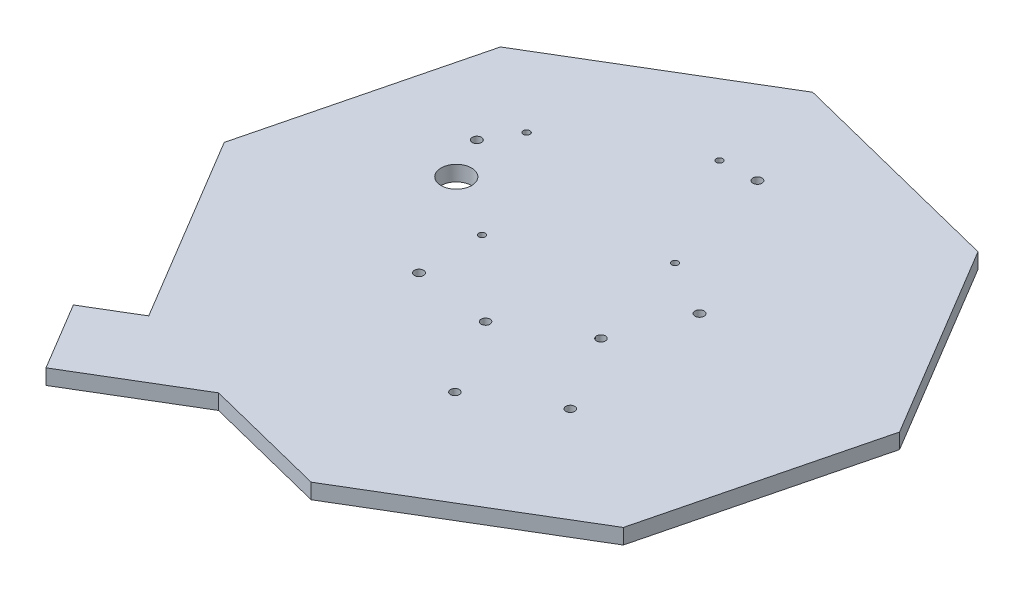
ISO-10303-21;
HEADER;
FILE_DESCRIPTION(('STEP AP214'),'2;1');
FILE_NAME('part.step','',(''),(''),'','','');
FILE_SCHEMA(('AUTOMOTIVE_DESIGN { 1 0 10303 214 1 1 1 1 }'));
ENDSEC;
DATA;
#1=APPLICATION_CONTEXT('core data for automotive mechanical design processes');
#2=APPLICATION_PROTOCOL_DEFINITION('international standard','automotive_design',2000,#1);
#3=PRODUCT_CONTEXT('',#1,'mechanical');
#4=PRODUCT('Part','Part','',(#3));
#5=PRODUCT_RELATED_PRODUCT_CATEGORY('part','',(#4));
#6=PRODUCT_DEFINITION_FORMATION('','',#4);
#7=PRODUCT_DEFINITION_CONTEXT('part definition',#1,'design');
#8=PRODUCT_DEFINITION('design','',#6,#7);
#9=PRODUCT_DEFINITION_SHAPE('','',#8);
#10=(LENGTH_UNIT() NAMED_UNIT(*) SI_UNIT(.MILLI.,.METRE.));
#11=(NAMED_UNIT(*) PLANE_ANGLE_UNIT() SI_UNIT($,.RADIAN.));
#12=(NAMED_UNIT(*) SI_UNIT($,.STERADIAN.) SOLID_ANGLE_UNIT());
#13=UNCERTAINTY_MEASURE_WITH_UNIT(LENGTH_MEASURE(1.E-05),#10,'distance_accuracy_value','');
#14=(GEOMETRIC_REPRESENTATION_CONTEXT(3) GLOBAL_UNCERTAINTY_ASSIGNED_CONTEXT((#13)) GLOBAL_UNIT_ASSIGNED_CONTEXT((#10,
#11,#12)) REPRESENTATION_CONTEXT('',''));
#15=CARTESIAN_POINT('',(0.,0.,0.));
#16=DIRECTION('',(0.,0.,1.));
#17=DIRECTION('',(1.,0.,0.));
#18=AXIS2_PLACEMENT_3D('',#15,#16,#17);
#19=CARTESIAN_POINT('',(122.390514677117,6.35,-18.0710827040052));
#20=DIRECTION('',(-0.858073020274862,0.,0.513527693387977));
#21=DIRECTION('',(0.513527693387977,0.,0.858073020274862));
#22=AXIS2_PLACEMENT_3D('',#19,#20,#21);
#23=PLANE('',#22);
#24=DIRECTION('',(-0.513527693387977,0.,-0.858073020274862));
#25=VECTOR('',#24,1.);
#26=CARTESIAN_POINT('',(122.390514677117,0.,-18.0710827040052));
#27=LINE('',#26,#25);
#28=CARTESIAN_POINT('',(122.390514677117,0.,-18.0710827040052));
#29=VERTEX_POINT('',#28);
#30=CARTESIAN_POINT('',(73.7649777577163,0.,-99.3213480044863));
#31=VERTEX_POINT('',#30);
#32=EDGE_CURVE('E165',#29,#31,#27,.T.);
#33=ORIENTED_EDGE('',*,*,#32,.T.);
#34=DIRECTION('',(0.,-1.,0.));
#35=VECTOR('',#34,1.);
#36=CARTESIAN_POINT('',(73.7649777577163,6.35,-99.3213480044863));
#37=LINE('',#36,#35);
#38=CARTESIAN_POINT('',(73.7649777577163,6.35,-99.3213480044863));
#39=VERTEX_POINT('',#38);
#40=EDGE_CURVE('E13',#39,#31,#37,.T.);
#41=ORIENTED_EDGE('',*,*,#40,.F.);
#42=DIRECTION('',(-0.513527693387977,0.,-0.858073020274862));
#43=VECTOR('',#42,1.);
#44=CARTESIAN_POINT('',(122.390514677117,6.35,-18.0710827040052));
#45=LINE('',#44,#43);
#46=CARTESIAN_POINT('',(122.390514677117,6.35,-18.0710827040052));
#47=VERTEX_POINT('',#46);
#48=EDGE_CURVE('E168',#47,#39,#45,.T.);
#49=ORIENTED_EDGE('',*,*,#48,.F.);
#50=DIRECTION('',(0.,-1.,0.));
#51=VECTOR('',#50,1.);
#52=CARTESIAN_POINT('',(122.390514677117,6.35,-18.0710827040052));
#53=LINE('',#52,#51);
#54=EDGE_CURVE('E185',#47,#29,#53,.T.);
#55=ORIENTED_EDGE('',*,*,#54,.T.);
#56=EDGE_LOOP('',(#33,#41,#49,#55));
#57=FACE_BOUND('',#56,.T.);
#58=ADVANCED_FACE('F44',(#57),#23,.F.);
#59=CARTESIAN_POINT('',(73.7649777577163,6.35,-99.3213480044863));
#60=DIRECTION('',(-0.243630337067852,0.,0.969868165711302));
#61=DIRECTION('',(0.969868165711302,0.,0.243630337067852));
#62=AXIS2_PLACEMENT_3D('',#59,#60,#61);
#63=PLANE('',#62);
#64=DIRECTION('',(-0.969868165711302,0.,-0.243630337067852));
#65=VECTOR('',#64,1.);
#66=CARTESIAN_POINT('',(73.7649777577163,0.,-99.3213480044863));
#67=LINE('',#66,#65);
#68=CARTESIAN_POINT('',(-18.0710827040052,0.,-122.390514677117));
#69=VERTEX_POINT('',#68);
#70=EDGE_CURVE('E188',#31,#69,#67,.T.);
#71=ORIENTED_EDGE('',*,*,#70,.T.);
#72=DIRECTION('',(0.,-1.,0.));
#73=VECTOR('',#72,1.);
#74=CARTESIAN_POINT('',(-18.0710827040052,6.35,-122.390514677117));
#75=LINE('',#74,#73);
#76=CARTESIAN_POINT('',(-18.0710827040052,6.35,-122.390514677117));
#77=VERTEX_POINT('',#76);
#78=EDGE_CURVE('E51',#77,#69,#75,.T.);
#79=ORIENTED_EDGE('',*,*,#78,.F.);
#80=DIRECTION('',(-0.969868165711302,0.,-0.243630337067852));
#81=VECTOR('',#80,1.);
#82=CARTESIAN_POINT('',(73.7649777577163,6.35,-99.3213480044863));
#83=LINE('',#82,#81);
#84=EDGE_CURVE('E171',#39,#77,#83,.T.);
#85=ORIENTED_EDGE('',*,*,#84,.F.);
#86=ORIENTED_EDGE('',*,*,#40,.T.);
#87=EDGE_LOOP('',(#71,#79,#85,#86));
#88=FACE_BOUND('',#87,.T.);
#89=ADVANCED_FACE('F233',(#88),#63,.F.);
#90=CARTESIAN_POINT('',(-18.0710827040052,6.35,-122.390514677117));
#91=DIRECTION('',(0.513527693387977,0.,0.858073020274862));
#92=DIRECTION('',(0.858073020274862,0.,-0.513527693387977));
#93=AXIS2_PLACEMENT_3D('',#90,#91,#92);
#94=PLANE('',#93);
#95=DIRECTION('',(-0.858073020274862,0.,0.513527693387977));
#96=VECTOR('',#95,1.);
#97=CARTESIAN_POINT('',(-18.0710827040052,0.,-122.390514677117));
#98=LINE('',#97,#96);
#99=CARTESIAN_POINT('',(-99.3213480044863,0.,-73.7649777577163));
#100=VERTEX_POINT('',#99);
#101=EDGE_CURVE('E190',#69,#100,#98,.T.);
#102=ORIENTED_EDGE('',*,*,#101,.T.);
#103=DIRECTION('',(0.,-1.,0.));
#104=VECTOR('',#103,1.);
#105=CARTESIAN_POINT('',(-99.3213480044863,6.35,-73.7649777577163));
#106=LINE('',#105,#104);
#107=CARTESIAN_POINT('',(-99.3213480044863,6.35,-73.7649777577163));
#108=VERTEX_POINT('',#107);
#109=EDGE_CURVE('E212',#108,#100,#106,.T.);
#110=ORIENTED_EDGE('',*,*,#109,.F.);
#111=DIRECTION('',(-0.858073020274862,0.,0.513527693387977));
#112=VECTOR('',#111,1.);
#113=CARTESIAN_POINT('',(-18.0710827040052,6.35,-122.390514677117));
#114=LINE('',#113,#112);
#115=EDGE_CURVE('E174',#77,#108,#114,.T.);
#116=ORIENTED_EDGE('',*,*,#115,.F.);
#117=ORIENTED_EDGE('',*,*,#78,.T.);
#118=EDGE_LOOP('',(#102,#110,#116,#117));
#119=FACE_BOUND('',#118,.T.);
#120=ADVANCED_FACE('F219',(#119),#94,.F.);
#121=CARTESIAN_POINT('',(-99.3213480044863,6.35,-73.7649777577163));
#122=DIRECTION('',(0.969868165711302,0.,0.243630337067852));
#123=DIRECTION('',(0.243630337067852,0.,-0.969868165711302));
#124=AXIS2_PLACEMENT_3D('',#121,#122,#123);
#125=PLANE('',#124);
#126=DIRECTION('',(-0.243630337067852,0.,0.969868165711302));
#127=VECTOR('',#126,1.);
#128=CARTESIAN_POINT('',(-99.3213480044863,0.,-73.7649777577163));
#129=LINE('',#128,#127);
#130=CARTESIAN_POINT('',(-122.390514677117,0.,18.0710827040053));
#131=VERTEX_POINT('',#130);
#132=EDGE_CURVE('E192',#100,#131,#129,.T.);
#133=ORIENTED_EDGE('',*,*,#132,.T.);
#134=DIRECTION('',(0.,-1.,0.));
#135=VECTOR('',#134,1.);
#136=CARTESIAN_POINT('',(-122.390514677117,6.35,18.0710827040053));
#137=LINE('',#136,#135);
#138=CARTESIAN_POINT('',(-122.390514677117,6.35,18.0710827040053));
#139=VERTEX_POINT('',#138);
#140=EDGE_CURVE('E209',#139,#131,#137,.T.);
#141=ORIENTED_EDGE('',*,*,#140,.F.);
#142=DIRECTION('',(-0.243630337067852,0.,0.969868165711302));
#143=VECTOR('',#142,1.);
#144=CARTESIAN_POINT('',(-99.3213480044863,6.35,-73.7649777577163));
#145=LINE('',#144,#143);
#146=EDGE_CURVE('E176',#108,#139,#145,.T.);
#147=ORIENTED_EDGE('',*,*,#146,.F.);
#148=ORIENTED_EDGE('',*,*,#109,.T.);
#149=EDGE_LOOP('',(#133,#141,#147,#148));
#150=FACE_BOUND('',#149,.T.);
#151=ADVANCED_FACE('F226',(#150),#125,.F.);
#152=CARTESIAN_POINT('',(-122.390514677117,6.35,18.0710827040053));
#153=DIRECTION('',(0.858073020274862,0.,-0.513527693387977));
#154=DIRECTION('',(-0.513527693387977,0.,-0.858073020274862));
#155=AXIS2_PLACEMENT_3D('',#152,#153,#154);
#156=PLANE('',#155);
#157=DIRECTION('',(0.513527693387977,0.,0.858073020274862));
#158=VECTOR('',#157,1.);
#159=CARTESIAN_POINT('',(-122.390514677117,0.,18.0710827040053));
#160=LINE('',#159,#158);
#161=CARTESIAN_POINT('',(-75.5910822354039,0.,96.2700403443889));
#162=VERTEX_POINT('',#161);
#163=EDGE_CURVE('E194',#131,#162,#160,.T.);
#164=ORIENTED_EDGE('',*,*,#163,.T.);
#165=DIRECTION('',(0.,1.,0.));
#166=VECTOR('',#165,1.);
#167=CARTESIAN_POINT('',(-75.5910822354039,0.,96.2700403443889));
#168=LINE('',#167,#166);
#169=CARTESIAN_POINT('',(-75.5910822354039,6.35,96.2700403443889));
#170=VERTEX_POINT('',#169);
#171=EDGE_CURVE('E66',#162,#170,#168,.T.);
#172=ORIENTED_EDGE('',*,*,#171,.T.);
#173=DIRECTION('',(0.513527693387977,0.,0.858073020274862));
#174=VECTOR('',#173,1.);
#175=CARTESIAN_POINT('',(-122.390514677117,6.35,18.0710827040053));
#176=LINE('',#175,#174);
#177=EDGE_CURVE('E178',#139,#170,#176,.T.);
#178=ORIENTED_EDGE('',*,*,#177,.F.);
#179=ORIENTED_EDGE('',*,*,#140,.T.);
#180=EDGE_LOOP('',(#164,#172,#178,#179));
#181=FACE_BOUND('',#180,.T.);
#182=ADVANCED_FACE('F228',(#181),#156,.F.);
#183=CARTESIAN_POINT('',(-73.7649777577163,6.35,99.3213480044863));
#184=DIRECTION('',(0.243630337067852,0.,-0.969868165711302));
#185=DIRECTION('',(-0.969868165711302,0.,-0.243630337067852));
#186=AXIS2_PLACEMENT_3D('',#183,#184,#185);
#187=PLANE('',#186);
#188=DIRECTION('',(0.969868165711302,0.,0.243630337067852));
#189=VECTOR('',#188,1.);
#190=CARTESIAN_POINT('',(-73.7649777577163,6.35,99.3213480044863));
#191=LINE('',#190,#189);
#192=CARTESIAN_POINT('',(-33.3521343303544,6.35,109.473031515881));
#193=VERTEX_POINT('',#192);
#194=CARTESIAN_POINT('',(18.0710827040052,6.35,122.390514677117));
#195=VERTEX_POINT('',#194);
#196=EDGE_CURVE('E58',#193,#195,#191,.T.);
#197=ORIENTED_EDGE('',*,*,#196,.F.);
#198=DIRECTION('',(0.,1.,0.));
#199=VECTOR('',#198,1.);
#200=CARTESIAN_POINT('',(-33.3521343303544,0.,109.473031515881));
#201=LINE('',#200,#199);
#202=CARTESIAN_POINT('',(-33.3521343303544,0.,109.473031515881));
#203=VERTEX_POINT('',#202);
#204=EDGE_CURVE('E163',#203,#193,#201,.T.);
#205=ORIENTED_EDGE('',*,*,#204,.F.);
#206=DIRECTION('',(0.969868165711302,0.,0.243630337067852));
#207=VECTOR('',#206,1.);
#208=CARTESIAN_POINT('',(-73.7649777577163,0.,99.3213480044863));
#209=LINE('',#208,#207);
#210=CARTESIAN_POINT('',(18.0710827040052,0.,122.390514677117));
#211=VERTEX_POINT('',#210);
#212=EDGE_CURVE('E196',#203,#211,#209,.T.);
#213=ORIENTED_EDGE('',*,*,#212,.T.);
#214=DIRECTION('',(0.,-1.,0.));
#215=VECTOR('',#214,1.);
#216=CARTESIAN_POINT('',(18.0710827040052,6.35,122.390514677117));
#217=LINE('',#216,#215);
#218=EDGE_CURVE('E206',#195,#211,#217,.T.);
#219=ORIENTED_EDGE('',*,*,#218,.F.);
#220=EDGE_LOOP('',(#197,#205,#213,#219));
#221=FACE_BOUND('',#220,.T.);
#222=ADVANCED_FACE('F245',(#221),#187,.F.);
#223=CARTESIAN_POINT('',(18.0710827040052,6.35,122.390514677117));
#224=DIRECTION('',(-0.513527693387977,0.,-0.858073020274862));
#225=DIRECTION('',(-0.858073020274862,0.,0.513527693387977));
#226=AXIS2_PLACEMENT_3D('',#223,#224,#225);
#227=PLANE('',#226);
#228=DIRECTION('',(0.858073020274862,0.,-0.513527693387977));
#229=VECTOR('',#228,1.);
#230=CARTESIAN_POINT('',(18.0710827040052,0.,122.390514677117));
#231=LINE('',#230,#229);
#232=CARTESIAN_POINT('',(99.3213480044863,0.,73.7649777577163));
#233=VERTEX_POINT('',#232);
#234=EDGE_CURVE('E198',#211,#233,#231,.T.);
#235=ORIENTED_EDGE('',*,*,#234,.T.);
#236=DIRECTION('',(0.,-1.,0.));
#237=VECTOR('',#236,1.);
#238=CARTESIAN_POINT('',(99.3213480044863,6.35,73.7649777577163));
#239=LINE('',#238,#237);
#240=CARTESIAN_POINT('',(99.3213480044863,6.35,73.7649777577163));
#241=VERTEX_POINT('',#240);
#242=EDGE_CURVE('E203',#241,#233,#239,.T.);
#243=ORIENTED_EDGE('',*,*,#242,.F.);
#244=DIRECTION('',(0.858073020274862,0.,-0.513527693387977));
#245=VECTOR('',#244,1.);
#246=CARTESIAN_POINT('',(18.0710827040052,6.35,122.390514677117));
#247=LINE('',#246,#245);
#248=EDGE_CURVE('E181',#195,#241,#247,.T.);
#249=ORIENTED_EDGE('',*,*,#248,.F.);
#250=ORIENTED_EDGE('',*,*,#218,.T.);
#251=EDGE_LOOP('',(#235,#243,#249,#250));
#252=FACE_BOUND('',#251,.T.);
#253=ADVANCED_FACE('F244',(#252),#227,.F.);
#254=CARTESIAN_POINT('',(99.3213480044863,6.35,73.7649777577163));
#255=DIRECTION('',(-0.969868165711302,0.,-0.243630337067852));
#256=DIRECTION('',(-0.243630337067852,0.,0.969868165711302));
#257=AXIS2_PLACEMENT_3D('',#254,#255,#256);
#258=PLANE('',#257);
#259=DIRECTION('',(0.243630337067852,0.,-0.969868165711302));
#260=VECTOR('',#259,1.);
#261=CARTESIAN_POINT('',(99.3213480044863,0.,73.7649777577163));
#262=LINE('',#261,#260);
#263=EDGE_CURVE('E172',#233,#29,#262,.T.);
#264=ORIENTED_EDGE('',*,*,#263,.T.);
#265=ORIENTED_EDGE('',*,*,#54,.F.);
#266=DIRECTION('',(0.243630337067852,0.,-0.969868165711302));
#267=VECTOR('',#266,1.);
#268=CARTESIAN_POINT('',(99.3213480044863,6.35,73.7649777577163));
#269=LINE('',#268,#267);
#270=EDGE_CURVE('E183',#241,#47,#269,.T.);
#271=ORIENTED_EDGE('',*,*,#270,.F.);
#272=ORIENTED_EDGE('',*,*,#242,.T.);
#273=EDGE_LOOP('',(#264,#265,#271,#272));
#274=FACE_BOUND('',#273,.T.);
#275=ADVANCED_FACE('F239',(#274),#258,.F.);
#276=CARTESIAN_POINT('',(39.381530863171,6.35,-156.773961571662));
#277=DIRECTION('',(0.,1.,0.));
#278=DIRECTION('',(0.,0.,1.));
#279=AXIS2_PLACEMENT_3D('',#276,#277,#278);
#280=PLANE('',#279);
#281=CARTESIAN_POINT('',(45.5711756113947,6.35,42.0686100720646));
#282=DIRECTION('',(0.,1.,0.));
#283=DIRECTION('',(0.,0.,1.));
#284=AXIS2_PLACEMENT_3D('',#281,#282,#283);
#285=CIRCLE('',#284,1.85000000000001);
#286=CARTESIAN_POINT('',(45.5711756113947,6.35,43.9186100720646));
#287=VERTEX_POINT('',#286);
#288=EDGE_CURVE('E348',#287,#287,#285,.T.);
#289=ORIENTED_EDGE('',*,*,#288,.F.);
#290=EDGE_LOOP('',(#289));
#291=FACE_BOUND('',#290,.T.);
#292=CARTESIAN_POINT('',(26.5706509560395,6.35,10.3199083218948));
#293=DIRECTION('',(0.,1.,0.));
#294=DIRECTION('',(0.,0.,1.));
#295=AXIS2_PLACEMENT_3D('',#292,#293,#294);
#296=CIRCLE('',#295,1.85);
#297=CARTESIAN_POINT('',(26.5706509560395,6.35,12.1699083218948));
#298=VERTEX_POINT('',#297);
#299=EDGE_CURVE('E350',#298,#298,#296,.T.);
#300=ORIENTED_EDGE('',*,*,#299,.F.);
#301=EDGE_LOOP('',(#300));
#302=FACE_BOUND('',#301,.T.);
#303=CARTESIAN_POINT('',(-3.46190475358064,6.35,28.293377590474));
#304=DIRECTION('',(0.,1.,0.));
#305=DIRECTION('',(0.,0.,1.));
#306=AXIS2_PLACEMENT_3D('',#303,#304,#305);
#307=CIRCLE('',#306,1.85);
#308=CARTESIAN_POINT('',(-3.46190475358064,6.35,30.143377590474));
#309=VERTEX_POINT('',#308);
#310=EDGE_CURVE('E356',#309,#309,#307,.T.);
#311=ORIENTED_EDGE('',*,*,#310,.F.);
#312=EDGE_LOOP('',(#311));
#313=FACE_BOUND('',#312,.T.);
#314=CARTESIAN_POINT('',(15.5386199017745,6.35,60.0420793406438));
#315=DIRECTION('',(0.,1.,0.));
#316=DIRECTION('',(0.,0.,1.));
#317=AXIS2_PLACEMENT_3D('',#314,#315,#316);
#318=CIRCLE('',#317,1.85);
#319=CARTESIAN_POINT('',(15.5386199017745,6.35,61.8920793406438));
#320=VERTEX_POINT('',#319);
#321=EDGE_CURVE('E362',#320,#320,#318,.T.);
#322=ORIENTED_EDGE('',*,*,#321,.F.);
#323=EDGE_LOOP('',(#322));
#324=FACE_BOUND('',#323,.T.);
#325=CARTESIAN_POINT('',(-34.8762662210874,6.35,24.5724175545645));
#326=DIRECTION('',(0.,-1.,0.));
#327=DIRECTION('',(0.,0.,-1.));
#328=AXIS2_PLACEMENT_3D('',#325,#326,#327);
#329=CIRCLE('',#328,1.905);
#330=CARTESIAN_POINT('',(-34.8762662210874,6.35,22.6674175545645));
#331=VERTEX_POINT('',#330);
#332=EDGE_CURVE('E371',#331,#331,#329,.T.);
#333=ORIENTED_EDGE('',*,*,#332,.T.);
#334=EDGE_LOOP('',(#333));
#335=FACE_BOUND('',#334,.T.);
#336=CARTESIAN_POINT('',(38.1371670741007,6.35,-19.1236538758185));
#337=DIRECTION('',(0.,-1.,0.));
#338=DIRECTION('',(0.,0.,-1.));
#339=AXIS2_PLACEMENT_3D('',#336,#337,#338);
#340=CIRCLE('',#339,1.905);
#341=CARTESIAN_POINT('',(38.1371670741007,6.35,-21.0286538758185));
#342=VERTEX_POINT('',#341);
#343=EDGE_CURVE('E377',#342,#342,#340,.T.);
#344=ORIENTED_EDGE('',*,*,#343,.T.);
#345=EDGE_LOOP('',(#344));
#346=FACE_BOUND('',#345,.T.);
#347=CARTESIAN_POINT('',(-70.7461756042376,6.35,-35.3639829116347));
#348=DIRECTION('',(0.,-1.,0.));
#349=DIRECTION('',(0.,0.,-1.));
#350=AXIS2_PLACEMENT_3D('',#347,#348,#349);
#351=CIRCLE('',#350,1.90500000000012);
#352=CARTESIAN_POINT('',(-70.7461756042376,6.35,-37.2689829116348));
#353=VERTEX_POINT('',#352);
#354=EDGE_CURVE('E383',#353,#353,#351,.T.);
#355=ORIENTED_EDGE('',*,*,#354,.T.);
#356=EDGE_LOOP('',(#355));
#357=FACE_BOUND('',#356,.T.);
#358=CARTESIAN_POINT('',(2.2672576909505,6.35,-79.0600543420177));
#359=DIRECTION('',(0.,-1.,0.));
#360=DIRECTION('',(0.,0.,-1.));
#361=AXIS2_PLACEMENT_3D('',#358,#359,#360);
#362=CIRCLE('',#361,1.90499999999999);
#363=CARTESIAN_POINT('',(2.2672576909505,6.35,-80.9650543420177));
#364=VERTEX_POINT('',#363);
#365=EDGE_CURVE('E389',#364,#364,#362,.T.);
#366=ORIENTED_EDGE('',*,*,#365,.T.);
#367=EDGE_LOOP('',(#366));
#368=FACE_BOUND('',#367,.T.);
#369=CARTESIAN_POINT('',(-61.7374407035275,6.35,-17.8144681380892));
#370=DIRECTION('',(0.,-1.,0.));
#371=DIRECTION('',(0.,0.,-1.));
#372=AXIS2_PLACEMENT_3D('',#369,#370,#371);
#373=CIRCLE('',#372,6.35);
#374=CARTESIAN_POINT('',(-61.7374407035275,6.35,-24.1644681380892));
#375=VERTEX_POINT('',#374);
#376=EDGE_CURVE('E395',#375,#375,#373,.T.);
#377=ORIENTED_EDGE('',*,*,#376,.T.);
#378=EDGE_LOOP('',(#377));
#379=FACE_BOUND('',#378,.T.);
#380=CARTESIAN_POINT('',(14.7947550289578,6.35,-32.2539175225384));
#381=DIRECTION('',(0.,-1.,0.));
#382=DIRECTION('',(0.,0.,-1.));
#383=AXIS2_PLACEMENT_3D('',#380,#381,#382);
#384=CIRCLE('',#383,1.3716);
#385=CARTESIAN_POINT('',(14.7947550289578,6.35,-33.6255175225384));
#386=VERTEX_POINT('',#385);
#387=EDGE_CURVE('E398',#386,#386,#384,.T.);
#388=ORIENTED_EDGE('',*,*,#387,.T.);
#389=EDGE_LOOP('',(#388));
#390=FACE_BOUND('',#389,.T.);
#391=CARTESIAN_POINT('',(-63.0560876535603,6.35,-48.3877849228927));
#392=DIRECTION('',(0.,-1.,0.));
#393=DIRECTION('',(0.,0.,-1.));
#394=AXIS2_PLACEMENT_3D('',#391,#392,#393);
#395=CIRCLE('',#394,1.3716);
#396=CARTESIAN_POINT('',(-63.0560876535603,6.35,-49.7593849228927));
#397=VERTEX_POINT('',#396);
#398=EDGE_CURVE('E404',#397,#397,#395,.T.);
#399=ORIENTED_EDGE('',*,*,#398,.T.);
#400=EDGE_LOOP('',(#399));
#401=FACE_BOUND('',#400,.T.);
#402=CARTESIAN_POINT('',(-35.4166920234166,6.35,-2.20406398184697));
#403=DIRECTION('',(0.,-1.,0.));
#404=DIRECTION('',(0.,0.,-1.));
#405=AXIS2_PLACEMENT_3D('',#402,#403,#404);
#406=CIRCLE('',#405,1.3716);
#407=CARTESIAN_POINT('',(-35.4166920234166,6.35,-3.57566398184697));
#408=VERTEX_POINT('',#407);
#409=EDGE_CURVE('E410',#408,#408,#406,.T.);
#410=ORIENTED_EDGE('',*,*,#409,.T.);
#411=EDGE_LOOP('',(#410));
#412=FACE_BOUND('',#411,.T.);
#413=CARTESIAN_POINT('',(-12.844640601186,6.35,-78.4376384635842));
#414=DIRECTION('',(0.,-1.,0.));
#415=DIRECTION('',(0.,0.,-1.));
#416=AXIS2_PLACEMENT_3D('',#413,#414,#415);
#417=CIRCLE('',#416,1.3716);
#418=CARTESIAN_POINT('',(-12.844640601186,6.35,-79.8092384635842));
#419=VERTEX_POINT('',#418);
#420=EDGE_CURVE('E161',#419,#419,#417,.T.);
#421=ORIENTED_EDGE('',*,*,#420,.T.);
#422=EDGE_LOOP('',(#421));
#423=FACE_BOUND('',#422,.T.);
#424=ORIENTED_EDGE('',*,*,#177,.T.);
#425=DIRECTION('',(-0.858073020274862,0.,0.513527693387977));
#426=VECTOR('',#425,1.);
#427=CARTESIAN_POINT('',(-75.5910822354039,6.35,96.2700403443889));
#428=LINE('',#427,#426);
#429=CARTESIAN_POINT('',(-95.2066314788873,6.35,108.009283415238));
#430=VERTEX_POINT('',#429);
#431=EDGE_CURVE('E159',#170,#430,#428,.T.);
#432=ORIENTED_EDGE('',*,*,#431,.T.);
#433=DIRECTION('',(0.513527693387978,0.,0.858073020274862));
#434=VECTOR('',#433,1.);
#435=CARTESIAN_POINT('',(-95.2066314788873,6.35,108.009283415238));
#436=LINE('',#435,#434);
#437=CARTESIAN_POINT('',(-78.2499470432163,6.35,136.342854544714));
#438=VERTEX_POINT('',#437);
#439=EDGE_CURVE('E133',#430,#438,#436,.T.);
#440=ORIENTED_EDGE('',*,*,#439,.T.);
#441=DIRECTION('',(0.858073020274862,0.,-0.513527693387977));
#442=VECTOR('',#441,1.);
#443=CARTESIAN_POINT('',(-78.2499470432163,6.35,136.342854544714));
#444=LINE('',#443,#442);
#445=EDGE_CURVE('E150',#438,#193,#444,.T.);
#446=ORIENTED_EDGE('',*,*,#445,.T.);
#447=ORIENTED_EDGE('',*,*,#196,.T.);
#448=ORIENTED_EDGE('',*,*,#248,.T.);
#449=ORIENTED_EDGE('',*,*,#270,.T.);
#450=ORIENTED_EDGE('',*,*,#48,.T.);
#451=ORIENTED_EDGE('',*,*,#84,.T.);
#452=ORIENTED_EDGE('',*,*,#115,.T.);
#453=ORIENTED_EDGE('',*,*,#146,.T.);
#454=EDGE_LOOP('',(#424,#432,#440,#446,#447,#448,#449,#450,#451,#452,#453));
#455=FACE_BOUND('',#454,.T.);
#456=ADVANCED_FACE('F230',(#291,#302,#313,#324,#335,#346,#357,#368,#379,#390,#401,#412,#423,
#455),#280,.T.);
#457=CARTESIAN_POINT('',(39.381530863171,0.,-156.773961571662));
#458=DIRECTION('',(0.,1.,0.));
#459=DIRECTION('',(0.,0.,1.));
#460=AXIS2_PLACEMENT_3D('',#457,#458,#459);
#461=PLANE('',#460);
#462=CARTESIAN_POINT('',(45.5711756113947,0.,42.0686100720646));
#463=DIRECTION('',(0.,1.,0.));
#464=DIRECTION('',(0.,0.,1.));
#465=AXIS2_PLACEMENT_3D('',#462,#463,#464);
#466=CIRCLE('',#465,1.85000000000001);
#467=CARTESIAN_POINT('',(45.5711756113947,0.,43.9186100720646));
#468=VERTEX_POINT('',#467);
#469=EDGE_CURVE('E345',#468,#468,#466,.T.);
#470=ORIENTED_EDGE('',*,*,#469,.T.);
#471=EDGE_LOOP('',(#470));
#472=FACE_BOUND('',#471,.T.);
#473=CARTESIAN_POINT('',(26.5706509560395,0.,10.3199083218948));
#474=DIRECTION('',(0.,1.,0.));
#475=DIRECTION('',(0.,0.,1.));
#476=AXIS2_PLACEMENT_3D('',#473,#474,#475);
#477=CIRCLE('',#476,1.85);
#478=CARTESIAN_POINT('',(26.5706509560395,0.,12.1699083218948));
#479=VERTEX_POINT('',#478);
#480=EDGE_CURVE('E353',#479,#479,#477,.T.);
#481=ORIENTED_EDGE('',*,*,#480,.T.);
#482=EDGE_LOOP('',(#481));
#483=FACE_BOUND('',#482,.T.);
#484=CARTESIAN_POINT('',(-3.46190475358064,0.,28.293377590474));
#485=DIRECTION('',(0.,1.,0.));
#486=DIRECTION('',(0.,0.,1.));
#487=AXIS2_PLACEMENT_3D('',#484,#485,#486);
#488=CIRCLE('',#487,1.85);
#489=CARTESIAN_POINT('',(-3.46190475358064,0.,30.143377590474));
#490=VERTEX_POINT('',#489);
#491=EDGE_CURVE('E359',#490,#490,#488,.T.);
#492=ORIENTED_EDGE('',*,*,#491,.T.);
#493=EDGE_LOOP('',(#492));
#494=FACE_BOUND('',#493,.T.);
#495=CARTESIAN_POINT('',(15.5386199017745,0.,60.0420793406438));
#496=DIRECTION('',(0.,1.,0.));
#497=DIRECTION('',(0.,0.,1.));
#498=AXIS2_PLACEMENT_3D('',#495,#496,#497);
#499=CIRCLE('',#498,1.85);
#500=CARTESIAN_POINT('',(15.5386199017745,0.,61.8920793406438));
#501=VERTEX_POINT('',#500);
#502=EDGE_CURVE('E365',#501,#501,#499,.T.);
#503=ORIENTED_EDGE('',*,*,#502,.T.);
#504=EDGE_LOOP('',(#503));
#505=FACE_BOUND('',#504,.T.);
#506=CARTESIAN_POINT('',(-34.8762662210874,0.,24.5724175545645));
#507=DIRECTION('',(0.,-1.,0.));
#508=DIRECTION('',(0.,0.,-1.));
#509=AXIS2_PLACEMENT_3D('',#506,#507,#508);
#510=CIRCLE('',#509,1.905);
#511=CARTESIAN_POINT('',(-34.8762662210874,0.,22.6674175545645));
#512=VERTEX_POINT('',#511);
#513=EDGE_CURVE('E368',#512,#512,#510,.T.);
#514=ORIENTED_EDGE('',*,*,#513,.F.);
#515=EDGE_LOOP('',(#514));
#516=FACE_BOUND('',#515,.T.);
#517=CARTESIAN_POINT('',(38.1371670741007,0.,-19.1236538758185));
#518=DIRECTION('',(0.,-1.,0.));
#519=DIRECTION('',(0.,0.,-1.));
#520=AXIS2_PLACEMENT_3D('',#517,#518,#519);
#521=CIRCLE('',#520,1.905);
#522=CARTESIAN_POINT('',(38.1371670741007,0.,-21.0286538758185));
#523=VERTEX_POINT('',#522);
#524=EDGE_CURVE('E374',#523,#523,#521,.T.);
#525=ORIENTED_EDGE('',*,*,#524,.F.);
#526=EDGE_LOOP('',(#525));
#527=FACE_BOUND('',#526,.T.);
#528=CARTESIAN_POINT('',(-70.7461756042376,0.,-35.3639829116347));
#529=DIRECTION('',(0.,-1.,0.));
#530=DIRECTION('',(0.,0.,-1.));
#531=AXIS2_PLACEMENT_3D('',#528,#529,#530);
#532=CIRCLE('',#531,1.90500000000012);
#533=CARTESIAN_POINT('',(-70.7461756042376,0.,-37.2689829116348));
#534=VERTEX_POINT('',#533);
#535=EDGE_CURVE('E380',#534,#534,#532,.T.);
#536=ORIENTED_EDGE('',*,*,#535,.F.);
#537=EDGE_LOOP('',(#536));
#538=FACE_BOUND('',#537,.T.);
#539=CARTESIAN_POINT('',(2.2672576909505,0.,-79.0600543420177));
#540=DIRECTION('',(0.,-1.,0.));
#541=DIRECTION('',(0.,0.,-1.));
#542=AXIS2_PLACEMENT_3D('',#539,#540,#541);
#543=CIRCLE('',#542,1.90499999999999);
#544=CARTESIAN_POINT('',(2.2672576909505,0.,-80.9650543420177));
#545=VERTEX_POINT('',#544);
#546=EDGE_CURVE('E386',#545,#545,#543,.T.);
#547=ORIENTED_EDGE('',*,*,#546,.F.);
#548=EDGE_LOOP('',(#547));
#549=FACE_BOUND('',#548,.T.);
#550=CARTESIAN_POINT('',(-61.7374407035275,0.,-17.8144681380892));
#551=DIRECTION('',(0.,-1.,0.));
#552=DIRECTION('',(0.,0.,-1.));
#553=AXIS2_PLACEMENT_3D('',#550,#551,#552);
#554=CIRCLE('',#553,6.35);
#555=CARTESIAN_POINT('',(-61.7374407035275,0.,-24.1644681380892));
#556=VERTEX_POINT('',#555);
#557=EDGE_CURVE('E392',#556,#556,#554,.T.);
#558=ORIENTED_EDGE('',*,*,#557,.F.);
#559=EDGE_LOOP('',(#558));
#560=FACE_BOUND('',#559,.T.);
#561=CARTESIAN_POINT('',(14.7947550289578,0.,-32.2539175225384));
#562=DIRECTION('',(0.,-1.,0.));
#563=DIRECTION('',(0.,0.,-1.));
#564=AXIS2_PLACEMENT_3D('',#561,#562,#563);
#565=CIRCLE('',#564,1.3716);
#566=CARTESIAN_POINT('',(14.7947550289578,0.,-33.6255175225384));
#567=VERTEX_POINT('',#566);
#568=EDGE_CURVE('E401',#567,#567,#565,.T.);
#569=ORIENTED_EDGE('',*,*,#568,.F.);
#570=EDGE_LOOP('',(#569));
#571=FACE_BOUND('',#570,.T.);
#572=CARTESIAN_POINT('',(-63.0560876535603,0.,-48.3877849228927));
#573=DIRECTION('',(0.,-1.,0.));
#574=DIRECTION('',(0.,0.,-1.));
#575=AXIS2_PLACEMENT_3D('',#572,#573,#574);
#576=CIRCLE('',#575,1.3716);
#577=CARTESIAN_POINT('',(-63.0560876535603,0.,-49.7593849228927));
#578=VERTEX_POINT('',#577);
#579=EDGE_CURVE('E407',#578,#578,#576,.T.);
#580=ORIENTED_EDGE('',*,*,#579,.F.);
#581=EDGE_LOOP('',(#580));
#582=FACE_BOUND('',#581,.T.);
#583=CARTESIAN_POINT('',(-35.4166920234166,0.,-2.20406398184697));
#584=DIRECTION('',(0.,-1.,0.));
#585=DIRECTION('',(0.,0.,-1.));
#586=AXIS2_PLACEMENT_3D('',#583,#584,#585);
#587=CIRCLE('',#586,1.3716);
#588=CARTESIAN_POINT('',(-35.4166920234166,0.,-3.57566398184697));
#589=VERTEX_POINT('',#588);
#590=EDGE_CURVE('E413',#589,#589,#587,.T.);
#591=ORIENTED_EDGE('',*,*,#590,.F.);
#592=EDGE_LOOP('',(#591));
#593=FACE_BOUND('',#592,.T.);
#594=CARTESIAN_POINT('',(-12.844640601186,0.,-78.4376384635842));
#595=DIRECTION('',(0.,-1.,0.));
#596=DIRECTION('',(0.,0.,-1.));
#597=AXIS2_PLACEMENT_3D('',#594,#595,#596);
#598=CIRCLE('',#597,1.3716);
#599=CARTESIAN_POINT('',(-12.844640601186,0.,-79.8092384635842));
#600=VERTEX_POINT('',#599);
#601=EDGE_CURVE('E155',#600,#600,#598,.T.);
#602=ORIENTED_EDGE('',*,*,#601,.F.);
#603=EDGE_LOOP('',(#602));
#604=FACE_BOUND('',#603,.T.);
#605=DIRECTION('',(-0.858073020274862,0.,0.513527693387977));
#606=VECTOR('',#605,1.);
#607=CARTESIAN_POINT('',(-75.5910822354039,0.,96.2700403443889));
#608=LINE('',#607,#606);
#609=CARTESIAN_POINT('',(-95.2066314788873,0.,108.009283415238));
#610=VERTEX_POINT('',#609);
#611=EDGE_CURVE('E145',#162,#610,#608,.T.);
#612=ORIENTED_EDGE('',*,*,#611,.F.);
#613=ORIENTED_EDGE('',*,*,#163,.F.);
#614=ORIENTED_EDGE('',*,*,#132,.F.);
#615=ORIENTED_EDGE('',*,*,#101,.F.);
#616=ORIENTED_EDGE('',*,*,#70,.F.);
#617=ORIENTED_EDGE('',*,*,#32,.F.);
#618=ORIENTED_EDGE('',*,*,#263,.F.);
#619=ORIENTED_EDGE('',*,*,#234,.F.);
#620=ORIENTED_EDGE('',*,*,#212,.F.);
#621=DIRECTION('',(0.858073020274862,0.,-0.513527693387977));
#622=VECTOR('',#621,1.);
#623=CARTESIAN_POINT('',(-78.2499470432163,0.,136.342854544714));
#624=LINE('',#623,#622);
#625=CARTESIAN_POINT('',(-78.2499470432163,0.,136.342854544714));
#626=VERTEX_POINT('',#625);
#627=EDGE_CURVE('E147',#626,#203,#624,.T.);
#628=ORIENTED_EDGE('',*,*,#627,.F.);
#629=DIRECTION('',(0.513527693387978,0.,0.858073020274862));
#630=VECTOR('',#629,1.);
#631=CARTESIAN_POINT('',(-95.2066314788873,0.,108.009283415238));
#632=LINE('',#631,#630);
#633=EDGE_CURVE('E131',#610,#626,#632,.T.);
#634=ORIENTED_EDGE('',*,*,#633,.F.);
#635=EDGE_LOOP('',(#612,#613,#614,#615,#616,#617,#618,#619,#620,#628,#634));
#636=FACE_BOUND('',#635,.T.);
#637=ADVANCED_FACE('F143',(#472,#483,#494,#505,#516,#527,#538,#549,#560,#571,#582,#593,#604,
#636),#461,.F.);
#638=CARTESIAN_POINT('',(-78.2499470432163,0.,136.342854544714));
#639=DIRECTION('',(0.513527693387977,0.,0.858073020274862));
#640=DIRECTION('',(0.858073020274862,0.,-0.513527693387977));
#641=AXIS2_PLACEMENT_3D('',#638,#639,#640);
#642=PLANE('',#641);
#643=ORIENTED_EDGE('',*,*,#445,.F.);
#644=DIRECTION('',(0.,1.,0.));
#645=VECTOR('',#644,1.);
#646=CARTESIAN_POINT('',(-78.2499470432163,0.,136.342854544714));
#647=LINE('',#646,#645);
#648=EDGE_CURVE('E138',#626,#438,#647,.T.);
#649=ORIENTED_EDGE('',*,*,#648,.F.);
#650=ORIENTED_EDGE('',*,*,#627,.T.);
#651=ORIENTED_EDGE('',*,*,#204,.T.);
#652=EDGE_LOOP('',(#643,#649,#650,#651));
#653=FACE_BOUND('',#652,.T.);
#654=ADVANCED_FACE('F248',(#653),#642,.T.);
#655=CARTESIAN_POINT('',(-95.2066314788873,0.,108.009283415238));
#656=DIRECTION('',(-0.858073020274862,0.,0.513527693387978));
#657=DIRECTION('',(0.513527693387978,0.,0.858073020274862));
#658=AXIS2_PLACEMENT_3D('',#655,#656,#657);
#659=PLANE('',#658);
#660=ORIENTED_EDGE('',*,*,#439,.F.);
#661=DIRECTION('',(0.,1.,0.));
#662=VECTOR('',#661,1.);
#663=CARTESIAN_POINT('',(-95.2066314788873,0.,108.009283415238));
#664=LINE('',#663,#662);
#665=EDGE_CURVE('E128',#610,#430,#664,.T.);
#666=ORIENTED_EDGE('',*,*,#665,.F.);
#667=ORIENTED_EDGE('',*,*,#633,.T.);
#668=ORIENTED_EDGE('',*,*,#648,.T.);
#669=EDGE_LOOP('',(#660,#666,#667,#668));
#670=FACE_BOUND('',#669,.T.);
#671=ADVANCED_FACE('F130',(#670),#659,.T.);
#672=CARTESIAN_POINT('',(-75.5910822354039,0.,96.2700403443889));
#673=DIRECTION('',(-0.513527693387977,0.,-0.858073020274862));
#674=DIRECTION('',(-0.858073020274862,0.,0.513527693387977));
#675=AXIS2_PLACEMENT_3D('',#672,#673,#674);
#676=PLANE('',#675);
#677=ORIENTED_EDGE('',*,*,#431,.F.);
#678=ORIENTED_EDGE('',*,*,#171,.F.);
#679=ORIENTED_EDGE('',*,*,#611,.T.);
#680=ORIENTED_EDGE('',*,*,#665,.T.);
#681=EDGE_LOOP('',(#677,#678,#679,#680));
#682=FACE_BOUND('',#681,.T.);
#683=ADVANCED_FACE('F149',(#682),#676,.T.);
#684=CARTESIAN_POINT('',(-12.844640601186,6.35,-78.4376384635842));
#685=DIRECTION('',(0.,-1.,0.));
#686=DIRECTION('',(0.,0.,-1.));
#687=AXIS2_PLACEMENT_3D('',#684,#685,#686);
#688=CYLINDRICAL_SURFACE('',#687,1.3716);
#689=ORIENTED_EDGE('',*,*,#420,.F.);
#690=EDGE_LOOP('',(#689));
#691=FACE_BOUND('',#690,.T.);
#692=ORIENTED_EDGE('',*,*,#601,.T.);
#693=EDGE_LOOP('',(#692));
#694=FACE_BOUND('',#693,.T.);
#695=ADVANCED_FACE('F283',(#691,#694),#688,.F.);
#696=CARTESIAN_POINT('',(-35.4166920234166,6.35,-2.20406398184697));
#697=DIRECTION('',(0.,-1.,0.));
#698=DIRECTION('',(0.,0.,-1.));
#699=AXIS2_PLACEMENT_3D('',#696,#697,#698);
#700=CYLINDRICAL_SURFACE('',#699,1.3716);
#701=ORIENTED_EDGE('',*,*,#409,.F.);
#702=EDGE_LOOP('',(#701));
#703=FACE_BOUND('',#702,.T.);
#704=ORIENTED_EDGE('',*,*,#590,.T.);
#705=EDGE_LOOP('',(#704));
#706=FACE_BOUND('',#705,.T.);
#707=ADVANCED_FACE('F287',(#703,#706),#700,.F.);
#708=CARTESIAN_POINT('',(-63.0560876535603,6.35,-48.3877849228927));
#709=DIRECTION('',(0.,-1.,0.));
#710=DIRECTION('',(0.,0.,-1.));
#711=AXIS2_PLACEMENT_3D('',#708,#709,#710);
#712=CYLINDRICAL_SURFACE('',#711,1.3716);
#713=ORIENTED_EDGE('',*,*,#398,.F.);
#714=EDGE_LOOP('',(#713));
#715=FACE_BOUND('',#714,.T.);
#716=ORIENTED_EDGE('',*,*,#579,.T.);
#717=EDGE_LOOP('',(#716));
#718=FACE_BOUND('',#717,.T.);
#719=ADVANCED_FACE('F292',(#715,#718),#712,.F.);
#720=CARTESIAN_POINT('',(14.7947550289578,6.35,-32.2539175225384));
#721=DIRECTION('',(0.,-1.,0.));
#722=DIRECTION('',(0.,0.,-1.));
#723=AXIS2_PLACEMENT_3D('',#720,#721,#722);
#724=CYLINDRICAL_SURFACE('',#723,1.3716);
#725=ORIENTED_EDGE('',*,*,#387,.F.);
#726=EDGE_LOOP('',(#725));
#727=FACE_BOUND('',#726,.T.);
#728=ORIENTED_EDGE('',*,*,#568,.T.);
#729=EDGE_LOOP('',(#728));
#730=FACE_BOUND('',#729,.T.);
#731=ADVANCED_FACE('F300',(#727,#730),#724,.F.);
#732=CARTESIAN_POINT('',(-61.7374407035275,6.35,-17.8144681380892));
#733=DIRECTION('',(0.,-1.,0.));
#734=DIRECTION('',(0.,0.,-1.));
#735=AXIS2_PLACEMENT_3D('',#732,#733,#734);
#736=CYLINDRICAL_SURFACE('',#735,6.35);
#737=ORIENTED_EDGE('',*,*,#376,.F.);
#738=EDGE_LOOP('',(#737));
#739=FACE_BOUND('',#738,.T.);
#740=ORIENTED_EDGE('',*,*,#557,.T.);
#741=EDGE_LOOP('',(#740));
#742=FACE_BOUND('',#741,.T.);
#743=ADVANCED_FACE('F304',(#739,#742),#736,.F.);
#744=CARTESIAN_POINT('',(2.2672576909505,6.35,-79.0600543420177));
#745=DIRECTION('',(0.,-1.,0.));
#746=DIRECTION('',(0.,0.,-1.));
#747=AXIS2_PLACEMENT_3D('',#744,#745,#746);
#748=CYLINDRICAL_SURFACE('',#747,1.90499999999999);
#749=ORIENTED_EDGE('',*,*,#365,.F.);
#750=EDGE_LOOP('',(#749));
#751=FACE_BOUND('',#750,.T.);
#752=ORIENTED_EDGE('',*,*,#546,.T.);
#753=EDGE_LOOP('',(#752));
#754=FACE_BOUND('',#753,.T.);
#755=ADVANCED_FACE('F308',(#751,#754),#748,.F.);
#756=CARTESIAN_POINT('',(-70.7461756042376,6.35,-35.3639829116347));
#757=DIRECTION('',(0.,-1.,0.));
#758=DIRECTION('',(0.,0.,-1.));
#759=AXIS2_PLACEMENT_3D('',#756,#757,#758);
#760=CYLINDRICAL_SURFACE('',#759,1.90500000000012);
#761=ORIENTED_EDGE('',*,*,#354,.F.);
#762=EDGE_LOOP('',(#761));
#763=FACE_BOUND('',#762,.T.);
#764=ORIENTED_EDGE('',*,*,#535,.T.);
#765=EDGE_LOOP('',(#764));
#766=FACE_BOUND('',#765,.T.);
#767=ADVANCED_FACE('F312',(#763,#766),#760,.F.);
#768=CARTESIAN_POINT('',(38.1371670741007,6.35,-19.1236538758185));
#769=DIRECTION('',(0.,-1.,0.));
#770=DIRECTION('',(0.,0.,-1.));
#771=AXIS2_PLACEMENT_3D('',#768,#769,#770);
#772=CYLINDRICAL_SURFACE('',#771,1.905);
#773=ORIENTED_EDGE('',*,*,#343,.F.);
#774=EDGE_LOOP('',(#773));
#775=FACE_BOUND('',#774,.T.);
#776=ORIENTED_EDGE('',*,*,#524,.T.);
#777=EDGE_LOOP('',(#776));
#778=FACE_BOUND('',#777,.T.);
#779=ADVANCED_FACE('F316',(#775,#778),#772,.F.);
#780=CARTESIAN_POINT('',(-34.8762662210874,6.35,24.5724175545645));
#781=DIRECTION('',(0.,-1.,0.));
#782=DIRECTION('',(0.,0.,-1.));
#783=AXIS2_PLACEMENT_3D('',#780,#781,#782);
#784=CYLINDRICAL_SURFACE('',#783,1.905);
#785=ORIENTED_EDGE('',*,*,#332,.F.);
#786=EDGE_LOOP('',(#785));
#787=FACE_BOUND('',#786,.T.);
#788=ORIENTED_EDGE('',*,*,#513,.T.);
#789=EDGE_LOOP('',(#788));
#790=FACE_BOUND('',#789,.T.);
#791=ADVANCED_FACE('F320',(#787,#790),#784,.F.);
#792=CARTESIAN_POINT('',(15.5386199017745,0.,60.0420793406438));
#793=DIRECTION('',(0.,1.,0.));
#794=DIRECTION('',(0.,0.,1.));
#795=AXIS2_PLACEMENT_3D('',#792,#793,#794);
#796=CYLINDRICAL_SURFACE('',#795,1.85);
#797=ORIENTED_EDGE('',*,*,#502,.F.);
#798=EDGE_LOOP('',(#797));
#799=FACE_BOUND('',#798,.T.);
#800=ORIENTED_EDGE('',*,*,#321,.T.);
#801=EDGE_LOOP('',(#800));
#802=FACE_BOUND('',#801,.T.);
#803=ADVANCED_FACE('F324',(#799,#802),#796,.F.);
#804=CARTESIAN_POINT('',(-3.46190475358064,0.,28.293377590474));
#805=DIRECTION('',(0.,1.,0.));
#806=DIRECTION('',(0.,0.,1.));
#807=AXIS2_PLACEMENT_3D('',#804,#805,#806);
#808=CYLINDRICAL_SURFACE('',#807,1.85);
#809=ORIENTED_EDGE('',*,*,#491,.F.);
#810=EDGE_LOOP('',(#809));
#811=FACE_BOUND('',#810,.T.);
#812=ORIENTED_EDGE('',*,*,#310,.T.);
#813=EDGE_LOOP('',(#812));
#814=FACE_BOUND('',#813,.T.);
#815=ADVANCED_FACE('F328',(#811,#814),#808,.F.);
#816=CARTESIAN_POINT('',(26.5706509560395,0.,10.3199083218948));
#817=DIRECTION('',(0.,1.,0.));
#818=DIRECTION('',(0.,0.,1.));
#819=AXIS2_PLACEMENT_3D('',#816,#817,#818);
#820=CYLINDRICAL_SURFACE('',#819,1.85);
#821=ORIENTED_EDGE('',*,*,#480,.F.);
#822=EDGE_LOOP('',(#821));
#823=FACE_BOUND('',#822,.T.);
#824=ORIENTED_EDGE('',*,*,#299,.T.);
#825=EDGE_LOOP('',(#824));
#826=FACE_BOUND('',#825,.T.);
#827=ADVANCED_FACE('F332',(#823,#826),#820,.F.);
#828=CARTESIAN_POINT('',(45.5711756113947,0.,42.0686100720646));
#829=DIRECTION('',(0.,1.,0.));
#830=DIRECTION('',(0.,0.,1.));
#831=AXIS2_PLACEMENT_3D('',#828,#829,#830);
#832=CYLINDRICAL_SURFACE('',#831,1.85000000000001);
#833=ORIENTED_EDGE('',*,*,#469,.F.);
#834=EDGE_LOOP('',(#833));
#835=FACE_BOUND('',#834,.T.);
#836=ORIENTED_EDGE('',*,*,#288,.T.);
#837=EDGE_LOOP('',(#836));
#838=FACE_BOUND('',#837,.T.);
#839=ADVANCED_FACE('F336',(#835,#838),#832,.F.);
#840=CLOSED_SHELL('',(#58,#89,#120,#151,#182,#222,#253,#275,#456,#637,#654,#671,#683,#695,#707,
#719,#731,#743,#755,#767,#779,#791,#803,#815,#827,#839));
#841=MANIFOLD_SOLID_BREP('B2',#840);
#842=ADVANCED_BREP_SHAPE_REPRESENTATION('',(#18,#841),#14);
#843=SHAPE_DEFINITION_REPRESENTATION(#9,#842);
ENDSEC;
END-ISO-10303-21;
